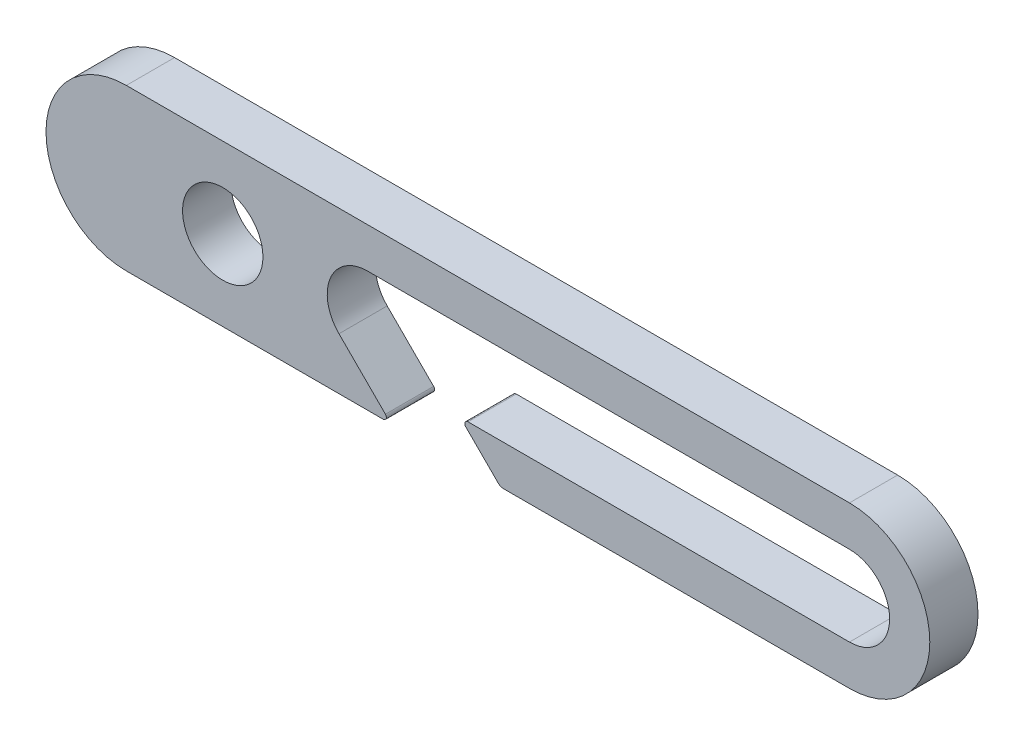
ISO-10303-21;
HEADER;
FILE_DESCRIPTION(('STEP AP214'),'2;1');
FILE_NAME('part.step','',(''),(''),'','','');
FILE_SCHEMA(('AUTOMOTIVE_DESIGN { 1 0 10303 214 1 1 1 1 }'));
ENDSEC;
DATA;
#1=APPLICATION_CONTEXT('core data for automotive mechanical design processes');
#2=APPLICATION_PROTOCOL_DEFINITION('international standard','automotive_design',2000,#1);
#3=PRODUCT_CONTEXT('',#1,'mechanical');
#4=PRODUCT('Part','Part','',(#3));
#5=PRODUCT_RELATED_PRODUCT_CATEGORY('part','',(#4));
#6=PRODUCT_DEFINITION_FORMATION('','',#4);
#7=PRODUCT_DEFINITION_CONTEXT('part definition',#1,'design');
#8=PRODUCT_DEFINITION('design','',#6,#7);
#9=PRODUCT_DEFINITION_SHAPE('','',#8);
#10=(LENGTH_UNIT() NAMED_UNIT(*) SI_UNIT(.MILLI.,.METRE.));
#11=(NAMED_UNIT(*) PLANE_ANGLE_UNIT() SI_UNIT($,.RADIAN.));
#12=(NAMED_UNIT(*) SI_UNIT($,.STERADIAN.) SOLID_ANGLE_UNIT());
#13=UNCERTAINTY_MEASURE_WITH_UNIT(LENGTH_MEASURE(1.E-05),#10,'distance_accuracy_value','');
#14=(GEOMETRIC_REPRESENTATION_CONTEXT(3) GLOBAL_UNCERTAINTY_ASSIGNED_CONTEXT((#13)) GLOBAL_UNIT_ASSIGNED_CONTEXT((#10,
#11,#12)) REPRESENTATION_CONTEXT('',''));
#15=CARTESIAN_POINT('',(0.,0.,0.));
#16=DIRECTION('',(0.,0.,1.));
#17=DIRECTION('',(1.,0.,0.));
#18=AXIS2_PLACEMENT_3D('',#15,#16,#17);
#19=CARTESIAN_POINT('',(0.,-4.14434226294018,3.));
#20=DIRECTION('',(0.,1.,0.));
#21=DIRECTION('',(-1.,0.,0.));
#22=AXIS2_PLACEMENT_3D('',#19,#20,#21);
#23=PLANE('',#22);
#24=DIRECTION('',(1.,0.,0.));
#25=VECTOR('',#24,1.);
#26=CARTESIAN_POINT('',(0.,-4.14434226294018,0.));
#27=LINE('',#26,#25);
#28=CARTESIAN_POINT('',(1.77037009881859,-4.14434226294018,0.));
#29=VERTEX_POINT('',#28);
#30=CARTESIAN_POINT('',(17.7519934804112,-4.14434226294018,0.));
#31=VERTEX_POINT('',#30);
#32=EDGE_CURVE('E171',#29,#31,#27,.T.);
#33=ORIENTED_EDGE('',*,*,#32,.T.);
#34=DIRECTION('',(0.,0.,-1.));
#35=VECTOR('',#34,1.);
#36=CARTESIAN_POINT('',(17.7519934804112,-4.14434226294018,3.));
#37=LINE('',#36,#35);
#38=CARTESIAN_POINT('',(17.7519934804112,-4.14434226294018,3.));
#39=VERTEX_POINT('',#38);
#40=EDGE_CURVE('E11',#39,#31,#37,.T.);
#41=ORIENTED_EDGE('',*,*,#40,.F.);
#42=DIRECTION('',(1.,0.,0.));
#43=VECTOR('',#42,1.);
#44=CARTESIAN_POINT('',(0.,-4.14434226294018,3.));
#45=LINE('',#44,#43);
#46=CARTESIAN_POINT('',(1.77037009881859,-4.14434226294018,3.));
#47=VERTEX_POINT('',#46);
#48=EDGE_CURVE('E248',#47,#39,#45,.T.);
#49=ORIENTED_EDGE('',*,*,#48,.F.);
#50=DIRECTION('',(0.,0.,-1.));
#51=VECTOR('',#50,1.);
#52=CARTESIAN_POINT('',(1.77037009881859,-4.14434226294018,3.));
#53=LINE('',#52,#51);
#54=EDGE_CURVE('E164',#47,#29,#53,.T.);
#55=ORIENTED_EDGE('',*,*,#54,.T.);
#56=EDGE_LOOP('',(#33,#41,#49,#55));
#57=FACE_BOUND('',#56,.T.);
#58=ADVANCED_FACE('F35',(#57),#23,.F.);
#59=CARTESIAN_POINT('',(17.7519934804112,-3.94434226294018,3.));
#60=DIRECTION('',(0.,0.,-1.));
#61=DIRECTION('',(-1.,0.,0.));
#62=AXIS2_PLACEMENT_3D('',#59,#60,#61);
#63=CYLINDRICAL_SURFACE('',#62,0.2);
#64=CARTESIAN_POINT('',(17.7519934804112,-3.94434226294018,0.));
#65=DIRECTION('',(0.,0.,1.));
#66=DIRECTION('',(1.,0.,0.));
#67=AXIS2_PLACEMENT_3D('',#64,#65,#66);
#68=CIRCLE('',#67,0.2);
#69=CARTESIAN_POINT('',(17.8934148366485,-3.80292090670287,0.));
#70=VERTEX_POINT('',#69);
#71=EDGE_CURVE('E174',#31,#70,#68,.T.);
#72=ORIENTED_EDGE('',*,*,#71,.T.);
#73=DIRECTION('',(0.,0.,-1.));
#74=VECTOR('',#73,1.);
#75=CARTESIAN_POINT('',(17.8934148366485,-3.80292090670287,3.));
#76=LINE('',#75,#74);
#77=CARTESIAN_POINT('',(17.8934148366485,-3.80292090670287,3.));
#78=VERTEX_POINT('',#77);
#79=EDGE_CURVE('E44',#78,#70,#76,.T.);
#80=ORIENTED_EDGE('',*,*,#79,.F.);
#81=CARTESIAN_POINT('',(17.7519934804112,-3.94434226294018,3.));
#82=DIRECTION('',(0.,0.,1.));
#83=DIRECTION('',(1.,0.,0.));
#84=AXIS2_PLACEMENT_3D('',#81,#82,#83);
#85=CIRCLE('',#84,0.2);
#86=EDGE_CURVE('E109',#39,#78,#85,.T.);
#87=ORIENTED_EDGE('',*,*,#86,.F.);
#88=ORIENTED_EDGE('',*,*,#40,.T.);
#89=EDGE_LOOP('',(#72,#80,#87,#88));
#90=FACE_BOUND('',#89,.T.);
#91=ADVANCED_FACE('F232',(#90),#63,.T.);
#92=CARTESIAN_POINT('',(7.04524696497288,7.04524696497283,3.));
#93=DIRECTION('',(0.707106781186549,0.707106781186545,0.));
#94=DIRECTION('',(-0.707106781186545,0.70710678118655,0.));
#95=AXIS2_PLACEMENT_3D('',#92,#93,#94);
#96=PLANE('',#95);
#97=DIRECTION('',(0.707106781186545,-0.70710678118655,0.));
#98=VECTOR('',#97,1.);
#99=CARTESIAN_POINT('',(7.04524696497288,7.04524696497283,0.));
#100=LINE('',#99,#98);
#101=CARTESIAN_POINT('',(15.0026031458522,-0.912109215906549,0.));
#102=VERTEX_POINT('',#101);
#103=EDGE_CURVE('E177',#102,#70,#100,.T.);
#104=ORIENTED_EDGE('',*,*,#103,.F.);
#105=DIRECTION('',(0.,0.,-1.));
#106=VECTOR('',#105,1.);
#107=CARTESIAN_POINT('',(15.0026031458522,-0.912109215906549,3.));
#108=LINE('',#107,#106);
#109=CARTESIAN_POINT('',(15.0026031458522,-0.912109215906549,3.));
#110=VERTEX_POINT('',#109);
#111=EDGE_CURVE('E225',#110,#102,#108,.T.);
#112=ORIENTED_EDGE('',*,*,#111,.F.);
#113=DIRECTION('',(0.707106781186545,-0.70710678118655,0.));
#114=VECTOR('',#113,1.);
#115=CARTESIAN_POINT('',(7.04524696497288,7.04524696497283,3.));
#116=LINE('',#115,#114);
#117=EDGE_CURVE('E231',#110,#78,#116,.T.);
#118=ORIENTED_EDGE('',*,*,#117,.T.);
#119=ORIENTED_EDGE('',*,*,#79,.T.);
#120=EDGE_LOOP('',(#104,#112,#118,#119));
#121=FACE_BOUND('',#120,.T.);
#122=ADVANCED_FACE('F229',(#121),#96,.T.);
#123=CARTESIAN_POINT('',(16.7703700988186,0.855657737059817,3.));
#124=DIRECTION('',(0.,0.,-1.));
#125=DIRECTION('',(-1.,0.,0.));
#126=AXIS2_PLACEMENT_3D('',#123,#124,#125);
#127=CYLINDRICAL_SURFACE('',#126,2.5);
#128=CARTESIAN_POINT('',(16.7703700988186,0.855657737059817,0.));
#129=DIRECTION('',(0.,0.,1.));
#130=DIRECTION('',(1.,0.,0.));
#131=AXIS2_PLACEMENT_3D('',#128,#129,#130);
#132=CIRCLE('',#131,2.5);
#133=CARTESIAN_POINT('',(16.7703700988186,3.35565773705982,0.));
#134=VERTEX_POINT('',#133);
#135=EDGE_CURVE('E180',#134,#102,#132,.T.);
#136=ORIENTED_EDGE('',*,*,#135,.F.);
#137=DIRECTION('',(0.,0.,-1.));
#138=VECTOR('',#137,1.);
#139=CARTESIAN_POINT('',(16.7703700988186,3.35565773705982,3.));
#140=LINE('',#139,#138);
#141=CARTESIAN_POINT('',(16.7703700988186,3.35565773705982,3.));
#142=VERTEX_POINT('',#141);
#143=EDGE_CURVE('E223',#142,#134,#140,.T.);
#144=ORIENTED_EDGE('',*,*,#143,.F.);
#145=CARTESIAN_POINT('',(16.7703700988186,0.855657737059817,3.));
#146=DIRECTION('',(0.,0.,1.));
#147=DIRECTION('',(1.,0.,0.));
#148=AXIS2_PLACEMENT_3D('',#145,#146,#147);
#149=CIRCLE('',#148,2.5);
#150=EDGE_CURVE('E244',#142,#110,#149,.T.);
#151=ORIENTED_EDGE('',*,*,#150,.T.);
#152=ORIENTED_EDGE('',*,*,#111,.T.);
#153=EDGE_LOOP('',(#136,#144,#151,#152));
#154=FACE_BOUND('',#153,.T.);
#155=ADVANCED_FACE('F240',(#154),#127,.F.);
#156=CARTESIAN_POINT('',(0.,3.35565773705982,3.));
#157=DIRECTION('',(0.,1.,0.));
#158=DIRECTION('',(-1.,0.,0.));
#159=AXIS2_PLACEMENT_3D('',#156,#157,#158);
#160=PLANE('',#159);
#161=DIRECTION('',(1.,0.,0.));
#162=VECTOR('',#161,1.);
#163=CARTESIAN_POINT('',(0.,3.35565773705982,0.));
#164=LINE('',#163,#162);
#165=CARTESIAN_POINT('',(46.7703700988186,3.35565773705982,0.));
#166=VERTEX_POINT('',#165);
#167=EDGE_CURVE('E183',#134,#166,#164,.T.);
#168=ORIENTED_EDGE('',*,*,#167,.T.);
#169=DIRECTION('',(0.,0.,-1.));
#170=VECTOR('',#169,1.);
#171=CARTESIAN_POINT('',(46.7703700988186,3.35565773705982,3.));
#172=LINE('',#171,#170);
#173=CARTESIAN_POINT('',(46.7703700988186,3.35565773705982,3.));
#174=VERTEX_POINT('',#173);
#175=EDGE_CURVE('E221',#174,#166,#172,.T.);
#176=ORIENTED_EDGE('',*,*,#175,.F.);
#177=DIRECTION('',(1.,0.,0.));
#178=VECTOR('',#177,1.);
#179=CARTESIAN_POINT('',(0.,3.35565773705982,3.));
#180=LINE('',#179,#178);
#181=EDGE_CURVE('E246',#142,#174,#180,.T.);
#182=ORIENTED_EDGE('',*,*,#181,.F.);
#183=ORIENTED_EDGE('',*,*,#143,.T.);
#184=EDGE_LOOP('',(#168,#176,#182,#183));
#185=FACE_BOUND('',#184,.T.);
#186=ADVANCED_FACE('F299',(#185),#160,.F.);
#187=CARTESIAN_POINT('',(46.7703700988186,0.855657737059817,3.));
#188=DIRECTION('',(0.,0.,-1.));
#189=DIRECTION('',(-1.,0.,0.));
#190=AXIS2_PLACEMENT_3D('',#187,#188,#189);
#191=CYLINDRICAL_SURFACE('',#190,2.5);
#192=CARTESIAN_POINT('',(46.7703700988186,0.855657737059817,0.));
#193=DIRECTION('',(0.,0.,1.));
#194=DIRECTION('',(1.,0.,0.));
#195=AXIS2_PLACEMENT_3D('',#192,#193,#194);
#196=CIRCLE('',#195,2.5);
#197=CARTESIAN_POINT('',(46.7703700988186,-1.64434226294018,0.));
#198=VERTEX_POINT('',#197);
#199=EDGE_CURVE('E186',#198,#166,#196,.T.);
#200=ORIENTED_EDGE('',*,*,#199,.F.);
#201=DIRECTION('',(0.,0.,-1.));
#202=VECTOR('',#201,1.);
#203=CARTESIAN_POINT('',(46.7703700988186,-1.64434226294018,3.));
#204=LINE('',#203,#202);
#205=CARTESIAN_POINT('',(46.7703700988186,-1.64434226294018,3.));
#206=VERTEX_POINT('',#205);
#207=EDGE_CURVE('E219',#206,#198,#204,.T.);
#208=ORIENTED_EDGE('',*,*,#207,.F.);
#209=CARTESIAN_POINT('',(46.7703700988186,0.855657737059817,3.));
#210=DIRECTION('',(0.,0.,1.));
#211=DIRECTION('',(1.,0.,0.));
#212=AXIS2_PLACEMENT_3D('',#209,#210,#211);
#213=CIRCLE('',#212,2.5);
#214=EDGE_CURVE('E253',#206,#174,#213,.T.);
#215=ORIENTED_EDGE('',*,*,#214,.T.);
#216=ORIENTED_EDGE('',*,*,#175,.T.);
#217=EDGE_LOOP('',(#200,#208,#215,#216));
#218=FACE_BOUND('',#217,.T.);
#219=ADVANCED_FACE('F302',(#218),#191,.F.);
#220=CARTESIAN_POINT('',(0.,-1.64434226294018,3.));
#221=DIRECTION('',(0.,1.,0.));
#222=DIRECTION('',(-1.,0.,0.));
#223=AXIS2_PLACEMENT_3D('',#220,#221,#222);
#224=PLANE('',#223);
#225=DIRECTION('',(1.,0.,0.));
#226=VECTOR('',#225,1.);
#227=CARTESIAN_POINT('',(0.,-1.64434226294018,0.));
#228=LINE('',#227,#226);
#229=CARTESIAN_POINT('',(23.0338667594888,-1.64434226294018,0.));
#230=VERTEX_POINT('',#229);
#231=EDGE_CURVE('E189',#230,#198,#228,.T.);
#232=ORIENTED_EDGE('',*,*,#231,.F.);
#233=DIRECTION('',(0.,0.,-1.));
#234=VECTOR('',#233,1.);
#235=CARTESIAN_POINT('',(23.0338667594888,-1.64434226294018,3.));
#236=LINE('',#235,#234);
#237=CARTESIAN_POINT('',(23.0338667594888,-1.64434226294018,3.));
#238=VERTEX_POINT('',#237);
#239=EDGE_CURVE('E217',#238,#230,#236,.T.);
#240=ORIENTED_EDGE('',*,*,#239,.F.);
#241=DIRECTION('',(1.,0.,0.));
#242=VECTOR('',#241,1.);
#243=CARTESIAN_POINT('',(0.,-1.64434226294018,3.));
#244=LINE('',#243,#242);
#245=EDGE_CURVE('E256',#238,#206,#244,.T.);
#246=ORIENTED_EDGE('',*,*,#245,.T.);
#247=ORIENTED_EDGE('',*,*,#207,.T.);
#248=EDGE_LOOP('',(#232,#240,#246,#247));
#249=FACE_BOUND('',#248,.T.);
#250=ADVANCED_FACE('F306',(#249),#224,.T.);
#251=CARTESIAN_POINT('',(23.0338667594888,-1.84434226294018,3.));
#252=DIRECTION('',(0.,0.,-1.));
#253=DIRECTION('',(-1.,0.,0.));
#254=AXIS2_PLACEMENT_3D('',#251,#252,#253);
#255=CYLINDRICAL_SURFACE('',#254,0.200000000000001);
#256=CARTESIAN_POINT('',(23.0338667594888,-1.84434226294018,0.));
#257=DIRECTION('',(0.,0.,1.));
#258=DIRECTION('',(1.,0.,0.));
#259=AXIS2_PLACEMENT_3D('',#256,#257,#258);
#260=CIRCLE('',#259,0.200000000000001);
#261=CARTESIAN_POINT('',(22.8924454032515,-1.9857636191775,0.));
#262=VERTEX_POINT('',#261);
#263=EDGE_CURVE('E192',#262,#230,#260,.F.);
#264=ORIENTED_EDGE('',*,*,#263,.F.);
#265=DIRECTION('',(0.,0.,-1.));
#266=VECTOR('',#265,1.);
#267=CARTESIAN_POINT('',(22.8924454032515,-1.9857636191775,3.));
#268=LINE('',#267,#266);
#269=CARTESIAN_POINT('',(22.8924454032515,-1.9857636191775,3.));
#270=VERTEX_POINT('',#269);
#271=EDGE_CURVE('E215',#270,#262,#268,.T.);
#272=ORIENTED_EDGE('',*,*,#271,.F.);
#273=CARTESIAN_POINT('',(23.0338667594888,-1.84434226294018,3.));
#274=DIRECTION('',(0.,0.,1.));
#275=DIRECTION('',(1.,0.,0.));
#276=AXIS2_PLACEMENT_3D('',#273,#274,#275);
#277=CIRCLE('',#276,0.200000000000001);
#278=EDGE_CURVE('E259',#270,#238,#277,.F.);
#279=ORIENTED_EDGE('',*,*,#278,.T.);
#280=ORIENTED_EDGE('',*,*,#239,.T.);
#281=EDGE_LOOP('',(#264,#272,#279,#280));
#282=FACE_BOUND('',#281,.T.);
#283=ADVANCED_FACE('F310',(#282),#255,.T.);
#284=CARTESIAN_POINT('',(10.4533408920371,10.453340892037,3.));
#285=DIRECTION('',(-0.70710678118655,-0.707106781186545,0.));
#286=DIRECTION('',(0.707106781186545,-0.70710678118655,0.));
#287=AXIS2_PLACEMENT_3D('',#284,#285,#286);
#288=PLANE('',#287);
#289=DIRECTION('',(-0.707106781186545,0.70710678118655,0.));
#290=VECTOR('',#289,1.);
#291=CARTESIAN_POINT('',(10.4533408920371,10.453340892037,0.));
#292=LINE('',#291,#290);
#293=CARTESIAN_POINT('',(24.9045774376074,-3.99789565353345,0.));
#294=VERTEX_POINT('',#293);
#295=EDGE_CURVE('E195',#294,#262,#292,.T.);
#296=ORIENTED_EDGE('',*,*,#295,.F.);
#297=DIRECTION('',(0.,0.,-1.));
#298=VECTOR('',#297,1.);
#299=CARTESIAN_POINT('',(24.9045774376074,-3.99789565353345,3.));
#300=LINE('',#299,#298);
#301=CARTESIAN_POINT('',(24.9045774376074,-3.99789565353345,3.));
#302=VERTEX_POINT('',#301);
#303=EDGE_CURVE('E213',#302,#294,#300,.T.);
#304=ORIENTED_EDGE('',*,*,#303,.F.);
#305=DIRECTION('',(-0.707106781186545,0.70710678118655,0.));
#306=VECTOR('',#305,1.);
#307=CARTESIAN_POINT('',(10.4533408920371,10.453340892037,3.));
#308=LINE('',#307,#306);
#309=EDGE_CURVE('E262',#302,#270,#308,.T.);
#310=ORIENTED_EDGE('',*,*,#309,.T.);
#311=ORIENTED_EDGE('',*,*,#271,.T.);
#312=EDGE_LOOP('',(#296,#304,#310,#311));
#313=FACE_BOUND('',#312,.T.);
#314=ADVANCED_FACE('F275',(#313),#288,.T.);
#315=CARTESIAN_POINT('',(25.2581308282007,-3.64434226294018,3.));
#316=DIRECTION('',(0.,0.,-1.));
#317=DIRECTION('',(-1.,0.,0.));
#318=AXIS2_PLACEMENT_3D('',#315,#316,#317);
#319=CYLINDRICAL_SURFACE('',#318,0.500000000000001);
#320=CARTESIAN_POINT('',(25.2581308282007,-3.64434226294018,0.));
#321=DIRECTION('',(0.,0.,1.));
#322=DIRECTION('',(1.,0.,0.));
#323=AXIS2_PLACEMENT_3D('',#320,#321,#322);
#324=CIRCLE('',#323,0.500000000000001);
#325=CARTESIAN_POINT('',(25.2581308282007,-4.14434226294018,0.));
#326=VERTEX_POINT('',#325);
#327=EDGE_CURVE('E198',#326,#294,#324,.F.);
#328=ORIENTED_EDGE('',*,*,#327,.F.);
#329=DIRECTION('',(0.,0.,-1.));
#330=VECTOR('',#329,1.);
#331=CARTESIAN_POINT('',(25.2581308282007,-4.14434226294018,3.));
#332=LINE('',#331,#330);
#333=CARTESIAN_POINT('',(25.2581308282007,-4.14434226294018,3.));
#334=VERTEX_POINT('',#333);
#335=EDGE_CURVE('E211',#334,#326,#332,.T.);
#336=ORIENTED_EDGE('',*,*,#335,.F.);
#337=CARTESIAN_POINT('',(25.2581308282007,-3.64434226294018,3.));
#338=DIRECTION('',(0.,0.,1.));
#339=DIRECTION('',(1.,0.,0.));
#340=AXIS2_PLACEMENT_3D('',#337,#338,#339);
#341=CIRCLE('',#340,0.500000000000001);
#342=EDGE_CURVE('E265',#334,#302,#341,.F.);
#343=ORIENTED_EDGE('',*,*,#342,.T.);
#344=ORIENTED_EDGE('',*,*,#303,.T.);
#345=EDGE_LOOP('',(#328,#336,#343,#344));
#346=FACE_BOUND('',#345,.T.);
#347=ADVANCED_FACE('F269',(#346),#319,.T.);
#348=CARTESIAN_POINT('',(0.,-4.14434226294019,3.));
#349=DIRECTION('',(0.,1.,0.));
#350=DIRECTION('',(-1.,0.,0.));
#351=AXIS2_PLACEMENT_3D('',#348,#349,#350);
#352=PLANE('',#351);
#353=DIRECTION('',(1.,0.,0.));
#354=VECTOR('',#353,1.);
#355=CARTESIAN_POINT('',(0.,-4.14434226294019,0.));
#356=LINE('',#355,#354);
#357=CARTESIAN_POINT('',(46.7703700988186,-4.14434226294018,0.));
#358=VERTEX_POINT('',#357);
#359=EDGE_CURVE('E201',#326,#358,#356,.T.);
#360=ORIENTED_EDGE('',*,*,#359,.T.);
#361=DIRECTION('',(0.,0.,-1.));
#362=VECTOR('',#361,1.);
#363=CARTESIAN_POINT('',(46.7703700988186,-4.14434226294018,3.));
#364=LINE('',#363,#362);
#365=CARTESIAN_POINT('',(46.7703700988186,-4.14434226294018,3.));
#366=VERTEX_POINT('',#365);
#367=EDGE_CURVE('E160',#366,#358,#364,.T.);
#368=ORIENTED_EDGE('',*,*,#367,.F.);
#369=DIRECTION('',(1.,0.,0.));
#370=VECTOR('',#369,1.);
#371=CARTESIAN_POINT('',(0.,-4.14434226294019,3.));
#372=LINE('',#371,#370);
#373=EDGE_CURVE('E147',#334,#366,#372,.T.);
#374=ORIENTED_EDGE('',*,*,#373,.F.);
#375=ORIENTED_EDGE('',*,*,#335,.T.);
#376=EDGE_LOOP('',(#360,#368,#374,#375));
#377=FACE_BOUND('',#376,.T.);
#378=ADVANCED_FACE('F279',(#377),#352,.F.);
#379=CARTESIAN_POINT('',(46.7703700988186,0.855657737059817,3.));
#380=DIRECTION('',(0.,0.,-1.));
#381=DIRECTION('',(-1.,0.,0.));
#382=AXIS2_PLACEMENT_3D('',#379,#380,#381);
#383=CYLINDRICAL_SURFACE('',#382,5.);
#384=CARTESIAN_POINT('',(46.7703700988186,0.855657737059817,0.));
#385=DIRECTION('',(0.,0.,1.));
#386=DIRECTION('',(1.,0.,0.));
#387=AXIS2_PLACEMENT_3D('',#384,#385,#386);
#388=CIRCLE('',#387,5.);
#389=CARTESIAN_POINT('',(46.7703700988186,5.85565773705982,0.));
#390=VERTEX_POINT('',#389);
#391=EDGE_CURVE('E156',#358,#390,#388,.T.);
#392=ORIENTED_EDGE('',*,*,#391,.T.);
#393=DIRECTION('',(0.,0.,-1.));
#394=VECTOR('',#393,1.);
#395=CARTESIAN_POINT('',(46.7703700988186,5.85565773705982,3.));
#396=LINE('',#395,#394);
#397=CARTESIAN_POINT('',(46.7703700988186,5.85565773705982,3.));
#398=VERTEX_POINT('',#397);
#399=EDGE_CURVE('E153',#398,#390,#396,.T.);
#400=ORIENTED_EDGE('',*,*,#399,.F.);
#401=CARTESIAN_POINT('',(46.7703700988186,0.855657737059817,3.));
#402=DIRECTION('',(0.,0.,1.));
#403=DIRECTION('',(1.,0.,0.));
#404=AXIS2_PLACEMENT_3D('',#401,#402,#403);
#405=CIRCLE('',#404,5.);
#406=EDGE_CURVE('E140',#366,#398,#405,.T.);
#407=ORIENTED_EDGE('',*,*,#406,.F.);
#408=ORIENTED_EDGE('',*,*,#367,.T.);
#409=EDGE_LOOP('',(#392,#400,#407,#408));
#410=FACE_BOUND('',#409,.T.);
#411=ADVANCED_FACE('F154',(#410),#383,.T.);
#412=CARTESIAN_POINT('',(0.,5.85565773705982,3.));
#413=DIRECTION('',(0.,1.,0.));
#414=DIRECTION('',(0.,0.,1.));
#415=AXIS2_PLACEMENT_3D('',#412,#413,#414);
#416=PLANE('',#415);
#417=DIRECTION('',(1.,0.,0.));
#418=VECTOR('',#417,1.);
#419=CARTESIAN_POINT('',(0.,5.85565773705982,0.));
#420=LINE('',#419,#418);
#421=CARTESIAN_POINT('',(1.77037009881859,5.85565773705982,0.));
#422=VERTEX_POINT('',#421);
#423=EDGE_CURVE('E204',#422,#390,#420,.T.);
#424=ORIENTED_EDGE('',*,*,#423,.F.);
#425=DIRECTION('',(0.,0.,-1.));
#426=VECTOR('',#425,1.);
#427=CARTESIAN_POINT('',(1.77037009881859,5.85565773705982,3.));
#428=LINE('',#427,#426);
#429=CARTESIAN_POINT('',(1.77037009881859,5.85565773705982,3.));
#430=VERTEX_POINT('',#429);
#431=EDGE_CURVE('E98',#430,#422,#428,.T.);
#432=ORIENTED_EDGE('',*,*,#431,.F.);
#433=DIRECTION('',(1.,0.,0.));
#434=VECTOR('',#433,1.);
#435=CARTESIAN_POINT('',(0.,5.85565773705982,3.));
#436=LINE('',#435,#434);
#437=EDGE_CURVE('E144',#430,#398,#436,.T.);
#438=ORIENTED_EDGE('',*,*,#437,.T.);
#439=ORIENTED_EDGE('',*,*,#399,.T.);
#440=EDGE_LOOP('',(#424,#432,#438,#439));
#441=FACE_BOUND('',#440,.T.);
#442=ADVANCED_FACE('F162',(#441),#416,.T.);
#443=CARTESIAN_POINT('',(7.77037009881859,0.855657737059817,3.));
#444=DIRECTION('',(0.,0.,-1.));
#445=DIRECTION('',(-1.,0.,0.));
#446=AXIS2_PLACEMENT_3D('',#443,#444,#445);
#447=CYLINDRICAL_SURFACE('',#446,2.49999999999992);
#448=CARTESIAN_POINT('',(7.77037009881859,0.855657737059817,3.));
#449=DIRECTION('',(0.,0.,1.));
#450=DIRECTION('',(1.,0.,0.));
#451=AXIS2_PLACEMENT_3D('',#448,#449,#450);
#452=CIRCLE('',#451,2.49999999999992);
#453=CARTESIAN_POINT('',(10.2703700988185,0.855657737059817,3.));
#454=VERTEX_POINT('',#453);
#455=EDGE_CURVE('E207',#454,#454,#452,.T.);
#456=ORIENTED_EDGE('',*,*,#455,.T.);
#457=EDGE_LOOP('',(#456));
#458=FACE_BOUND('',#457,.T.);
#459=CARTESIAN_POINT('',(7.77037009881859,0.855657737059817,0.));
#460=DIRECTION('',(0.,0.,1.));
#461=DIRECTION('',(1.,0.,0.));
#462=AXIS2_PLACEMENT_3D('',#459,#460,#461);
#463=CIRCLE('',#462,2.49999999999992);
#464=CARTESIAN_POINT('',(10.2703700988185,0.855657737059817,0.));
#465=VERTEX_POINT('',#464);
#466=EDGE_CURVE('E168',#465,#465,#463,.T.);
#467=ORIENTED_EDGE('',*,*,#466,.F.);
#468=EDGE_LOOP('',(#467));
#469=FACE_BOUND('',#468,.T.);
#470=ADVANCED_FACE('F37',(#458,#469),#447,.F.);
#471=CARTESIAN_POINT('',(1.77037009881859,0.855657737059817,3.));
#472=DIRECTION('',(0.,0.,-1.));
#473=DIRECTION('',(-1.,0.,0.));
#474=AXIS2_PLACEMENT_3D('',#471,#472,#473);
#475=CYLINDRICAL_SURFACE('',#474,5.);
#476=CARTESIAN_POINT('',(1.77037009881859,0.855657737059817,0.));
#477=DIRECTION('',(0.,0.,1.));
#478=DIRECTION('',(1.,0.,0.));
#479=AXIS2_PLACEMENT_3D('',#476,#477,#478);
#480=CIRCLE('',#479,5.);
#481=EDGE_CURVE('E101',#422,#29,#480,.T.);
#482=ORIENTED_EDGE('',*,*,#481,.T.);
#483=ORIENTED_EDGE('',*,*,#54,.F.);
#484=CARTESIAN_POINT('',(1.77037009881859,0.855657737059817,3.));
#485=DIRECTION('',(0.,0.,1.));
#486=DIRECTION('',(1.,0.,0.));
#487=AXIS2_PLACEMENT_3D('',#484,#485,#486);
#488=CIRCLE('',#487,5.);
#489=EDGE_CURVE('E52',#430,#47,#488,.T.);
#490=ORIENTED_EDGE('',*,*,#489,.F.);
#491=ORIENTED_EDGE('',*,*,#431,.T.);
#492=EDGE_LOOP('',(#482,#483,#490,#491));
#493=FACE_BOUND('',#492,.T.);
#494=ADVANCED_FACE('F351',(#493),#475,.T.);
#495=CARTESIAN_POINT('',(0.,0.,3.));
#496=DIRECTION('',(0.,0.,1.));
#497=DIRECTION('',(1.,0.,0.));
#498=AXIS2_PLACEMENT_3D('',#495,#496,#497);
#499=PLANE('',#498);
#500=ORIENTED_EDGE('',*,*,#455,.F.);
#501=EDGE_LOOP('',(#500));
#502=FACE_BOUND('',#501,.T.);
#503=ORIENTED_EDGE('',*,*,#48,.T.);
#504=ORIENTED_EDGE('',*,*,#86,.T.);
#505=ORIENTED_EDGE('',*,*,#117,.F.);
#506=ORIENTED_EDGE('',*,*,#150,.F.);
#507=ORIENTED_EDGE('',*,*,#181,.T.);
#508=ORIENTED_EDGE('',*,*,#214,.F.);
#509=ORIENTED_EDGE('',*,*,#245,.F.);
#510=ORIENTED_EDGE('',*,*,#278,.F.);
#511=ORIENTED_EDGE('',*,*,#309,.F.);
#512=ORIENTED_EDGE('',*,*,#342,.F.);
#513=ORIENTED_EDGE('',*,*,#373,.T.);
#514=ORIENTED_EDGE('',*,*,#406,.T.);
#515=ORIENTED_EDGE('',*,*,#437,.F.);
#516=ORIENTED_EDGE('',*,*,#489,.T.);
#517=EDGE_LOOP('',(#503,#504,#505,#506,#507,#508,#509,#510,#511,#512,#513,#514,#515,#516));
#518=FACE_BOUND('',#517,.T.);
#519=ADVANCED_FACE('F142',(#502,#518),#499,.T.);
#520=CARTESIAN_POINT('',(0.,0.,0.));
#521=DIRECTION('',(0.,0.,1.));
#522=DIRECTION('',(1.,0.,0.));
#523=AXIS2_PLACEMENT_3D('',#520,#521,#522);
#524=PLANE('',#523);
#525=ORIENTED_EDGE('',*,*,#466,.T.);
#526=EDGE_LOOP('',(#525));
#527=FACE_BOUND('',#526,.T.);
#528=ORIENTED_EDGE('',*,*,#32,.F.);
#529=ORIENTED_EDGE('',*,*,#481,.F.);
#530=ORIENTED_EDGE('',*,*,#423,.T.);
#531=ORIENTED_EDGE('',*,*,#391,.F.);
#532=ORIENTED_EDGE('',*,*,#359,.F.);
#533=ORIENTED_EDGE('',*,*,#327,.T.);
#534=ORIENTED_EDGE('',*,*,#295,.T.);
#535=ORIENTED_EDGE('',*,*,#263,.T.);
#536=ORIENTED_EDGE('',*,*,#231,.T.);
#537=ORIENTED_EDGE('',*,*,#199,.T.);
#538=ORIENTED_EDGE('',*,*,#167,.F.);
#539=ORIENTED_EDGE('',*,*,#135,.T.);
#540=ORIENTED_EDGE('',*,*,#103,.T.);
#541=ORIENTED_EDGE('',*,*,#71,.F.);
#542=EDGE_LOOP('',(#528,#529,#530,#531,#532,#533,#534,#535,#536,#537,#538,#539,#540,#541));
#543=FACE_BOUND('',#542,.T.);
#544=ADVANCED_FACE('F236',(#527,#543),#524,.F.);
#545=CLOSED_SHELL('',(#58,#91,#122,#155,#186,#219,#250,#283,#314,#347,#378,#411,#442,#470,#494,
#519,#544));
#546=MANIFOLD_SOLID_BREP('B2',#545);
#547=ADVANCED_BREP_SHAPE_REPRESENTATION('',(#18,#546),#14);
#548=SHAPE_DEFINITION_REPRESENTATION(#9,#547);
ENDSEC;
END-ISO-10303-21;
